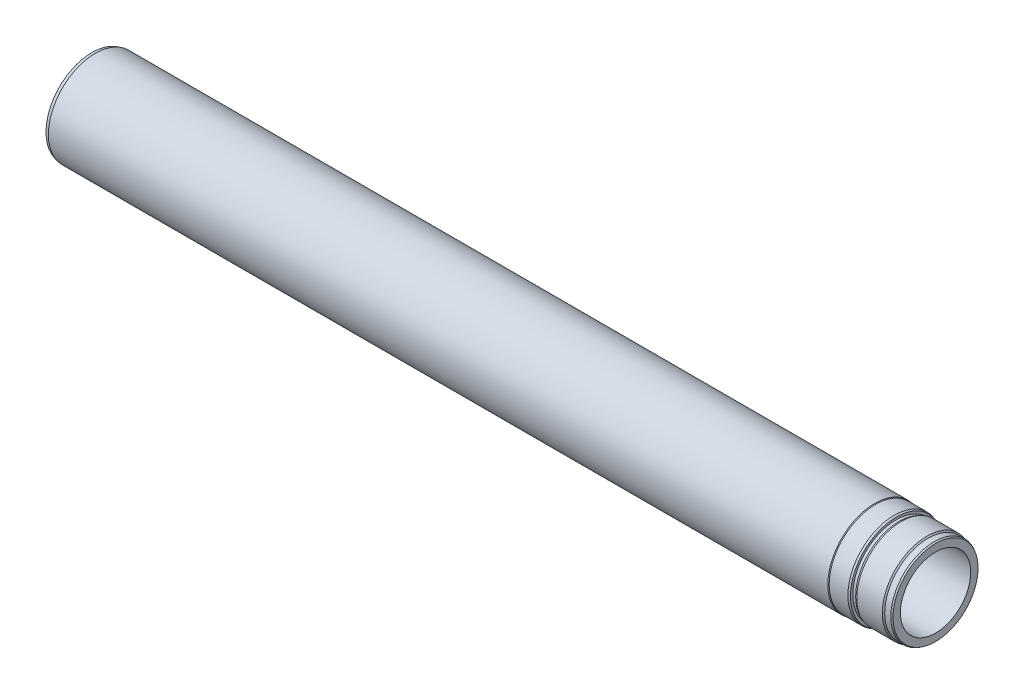
ISO-10303-21;
HEADER;
FILE_DESCRIPTION(('STEP AP214'),'2;1');
FILE_NAME('part.step','',(''),(''),'','','');
FILE_SCHEMA(('AUTOMOTIVE_DESIGN { 1 0 10303 214 1 1 1 1 }'));
ENDSEC;
DATA;
#1=APPLICATION_CONTEXT('core data for automotive mechanical design processes');
#2=APPLICATION_PROTOCOL_DEFINITION('international standard','automotive_design',2000,#1);
#3=PRODUCT_CONTEXT('',#1,'mechanical');
#4=PRODUCT('Part','Part','',(#3));
#5=PRODUCT_RELATED_PRODUCT_CATEGORY('part','',(#4));
#6=PRODUCT_DEFINITION_FORMATION('','',#4);
#7=PRODUCT_DEFINITION_CONTEXT('part definition',#1,'design');
#8=PRODUCT_DEFINITION('design','',#6,#7);
#9=PRODUCT_DEFINITION_SHAPE('','',#8);
#10=(LENGTH_UNIT() NAMED_UNIT(*) SI_UNIT(.MILLI.,.METRE.));
#11=(NAMED_UNIT(*) PLANE_ANGLE_UNIT() SI_UNIT($,.RADIAN.));
#12=(NAMED_UNIT(*) SI_UNIT($,.STERADIAN.) SOLID_ANGLE_UNIT());
#13=UNCERTAINTY_MEASURE_WITH_UNIT(LENGTH_MEASURE(1.E-05),#10,'distance_accuracy_value','');
#14=(GEOMETRIC_REPRESENTATION_CONTEXT(3) GLOBAL_UNCERTAINTY_ASSIGNED_CONTEXT((#13)) GLOBAL_UNIT_ASSIGNED_CONTEXT((#10,
#11,#12)) REPRESENTATION_CONTEXT('',''));
#15=CARTESIAN_POINT('',(0.,0.,0.));
#16=DIRECTION('',(0.,0.,1.));
#17=DIRECTION('',(1.,0.,0.));
#18=AXIS2_PLACEMENT_3D('',#15,#16,#17);
#19=CARTESIAN_POINT('',(-42.,0.,0.));
#20=DIRECTION('',(-1.,0.,0.));
#21=DIRECTION('',(0.,0.,1.));
#22=AXIS2_PLACEMENT_3D('',#19,#20,#21);
#23=CONICAL_SURFACE('',#22,48.7720595314676,0.349065850398868);
#24=CARTESIAN_POINT('',(-44.,0.,0.));
#25=DIRECTION('',(-1.,0.,0.));
#26=DIRECTION('',(0.,0.,1.));
#27=AXIS2_PLACEMENT_3D('',#24,#25,#26);
#28=CIRCLE('',#27,49.5);
#29=CARTESIAN_POINT('',(-44.,0.,49.5));
#30=VERTEX_POINT('',#29);
#31=EDGE_CURVE('E10',#30,#30,#28,.T.);
#32=ORIENTED_EDGE('',*,*,#31,.F.);
#33=EDGE_LOOP('',(#32));
#34=FACE_BOUND('',#33,.T.);
#35=CARTESIAN_POINT('',(-42.,0.,0.));
#36=DIRECTION('',(-1.,0.,0.));
#37=DIRECTION('',(0.,0.,1.));
#38=AXIS2_PLACEMENT_3D('',#35,#36,#37);
#39=CIRCLE('',#38,48.7720595314676);
#40=CARTESIAN_POINT('',(-42.,0.,48.7720595314676));
#41=VERTEX_POINT('',#40);
#42=EDGE_CURVE('E111',#41,#41,#39,.T.);
#43=ORIENTED_EDGE('',*,*,#42,.T.);
#44=EDGE_LOOP('',(#43));
#45=FACE_BOUND('',#44,.T.);
#46=ADVANCED_FACE('F47',(#34,#45),#23,.T.);
#47=CARTESIAN_POINT('',(-900.,0.,0.));
#48=DIRECTION('',(-1.,0.,0.));
#49=DIRECTION('',(0.,0.,1.));
#50=AXIS2_PLACEMENT_3D('',#47,#48,#49);
#51=CYLINDRICAL_SURFACE('',#50,49.5);
#52=CARTESIAN_POINT('',(-63.9999999999999,0.,0.));
#53=DIRECTION('',(-1.,0.,0.));
#54=DIRECTION('',(0.,0.,1.));
#55=AXIS2_PLACEMENT_3D('',#52,#53,#54);
#56=CIRCLE('',#55,49.5);
#57=CARTESIAN_POINT('',(-63.9999999999999,0.,49.5));
#58=VERTEX_POINT('',#57);
#59=EDGE_CURVE('E53',#58,#58,#56,.T.);
#60=ORIENTED_EDGE('',*,*,#59,.F.);
#61=EDGE_LOOP('',(#60));
#62=FACE_BOUND('',#61,.T.);
#63=ORIENTED_EDGE('',*,*,#31,.T.);
#64=EDGE_LOOP('',(#63));
#65=FACE_BOUND('',#64,.T.);
#66=ADVANCED_FACE('F128',(#62,#65),#51,.T.);
#67=CARTESIAN_POINT('',(-63.9999999999999,0.,0.));
#68=DIRECTION('',(-1.,0.,0.));
#69=DIRECTION('',(0.,0.,1.));
#70=AXIS2_PLACEMENT_3D('',#67,#68,#69);
#71=CONICAL_SURFACE('',#70,49.5,0.523598775598297);
#72=CARTESIAN_POINT('',(-64.8660254037844,0.,0.));
#73=DIRECTION('',(-1.,0.,0.));
#74=DIRECTION('',(0.,0.,1.));
#75=AXIS2_PLACEMENT_3D('',#72,#73,#74);
#76=CIRCLE('',#75,50.);
#77=CARTESIAN_POINT('',(-64.8660254037844,0.,50.));
#78=VERTEX_POINT('',#77);
#79=EDGE_CURVE('E57',#78,#78,#76,.T.);
#80=ORIENTED_EDGE('',*,*,#79,.F.);
#81=EDGE_LOOP('',(#80));
#82=FACE_BOUND('',#81,.T.);
#83=ORIENTED_EDGE('',*,*,#59,.T.);
#84=EDGE_LOOP('',(#83));
#85=FACE_BOUND('',#84,.T.);
#86=ADVANCED_FACE('F133',(#82,#85),#71,.T.);
#87=CARTESIAN_POINT('',(-900.,0.,0.));
#88=DIRECTION('',(-1.,0.,0.));
#89=DIRECTION('',(0.,0.,1.));
#90=AXIS2_PLACEMENT_3D('',#87,#88,#89);
#91=CYLINDRICAL_SURFACE('',#90,50.);
#92=CARTESIAN_POINT('',(-896.5,0.,0.));
#93=DIRECTION('',(-1.,0.,0.));
#94=DIRECTION('',(0.,0.,1.));
#95=AXIS2_PLACEMENT_3D('',#92,#93,#94);
#96=CIRCLE('',#95,49.9999999999999);
#97=CARTESIAN_POINT('',(-896.5,0.,49.9999999999999));
#98=VERTEX_POINT('',#97);
#99=EDGE_CURVE('E61',#98,#98,#96,.T.);
#100=ORIENTED_EDGE('',*,*,#99,.F.);
#101=EDGE_LOOP('',(#100));
#102=FACE_BOUND('',#101,.T.);
#103=ORIENTED_EDGE('',*,*,#79,.T.);
#104=EDGE_LOOP('',(#103));
#105=FACE_BOUND('',#104,.T.);
#106=ADVANCED_FACE('F138',(#102,#105),#91,.T.);
#107=CARTESIAN_POINT('',(-896.5,0.,0.));
#108=DIRECTION('',(1.,0.,0.));
#109=DIRECTION('',(0.,0.,-1.));
#110=AXIS2_PLACEMENT_3D('',#107,#108,#109);
#111=CONICAL_SURFACE('',#110,49.9999999999999,0.261799387799151);
#112=CARTESIAN_POINT('',(-900.,0.,0.));
#113=DIRECTION('',(-1.,0.,0.));
#114=DIRECTION('',(0.,0.,1.));
#115=AXIS2_PLACEMENT_3D('',#112,#113,#114);
#116=CIRCLE('',#115,49.062177826491);
#117=CARTESIAN_POINT('',(-900.,0.,49.062177826491));
#118=VERTEX_POINT('',#117);
#119=EDGE_CURVE('E66',#118,#118,#116,.T.);
#120=ORIENTED_EDGE('',*,*,#119,.F.);
#121=EDGE_LOOP('',(#120));
#122=FACE_BOUND('',#121,.T.);
#123=ORIENTED_EDGE('',*,*,#99,.T.);
#124=EDGE_LOOP('',(#123));
#125=FACE_BOUND('',#124,.T.);
#126=ADVANCED_FACE('F144',(#122,#125),#111,.T.);
#127=CARTESIAN_POINT('',(-900.,49.062177826491,0.));
#128=DIRECTION('',(1.,0.,0.));
#129=DIRECTION('',(0.,0.,-1.));
#130=AXIS2_PLACEMENT_3D('',#127,#128,#129);
#131=PLANE('',#130);
#132=CARTESIAN_POINT('',(-900.,0.,0.));
#133=DIRECTION('',(-1.,0.,0.));
#134=DIRECTION('',(0.,0.,1.));
#135=AXIS2_PLACEMENT_3D('',#132,#133,#134);
#136=CIRCLE('',#135,41.75);
#137=CARTESIAN_POINT('',(-900.,0.,41.75));
#138=VERTEX_POINT('',#137);
#139=EDGE_CURVE('E69',#138,#138,#136,.T.);
#140=ORIENTED_EDGE('',*,*,#139,.F.);
#141=EDGE_LOOP('',(#140));
#142=FACE_BOUND('',#141,.T.);
#143=ORIENTED_EDGE('',*,*,#119,.T.);
#144=EDGE_LOOP('',(#143));
#145=FACE_BOUND('',#144,.T.);
#146=ADVANCED_FACE('F148',(#142,#145),#131,.F.);
#147=CARTESIAN_POINT('',(-900.,0.,0.));
#148=DIRECTION('',(-1.,0.,0.));
#149=DIRECTION('',(0.,0.,1.));
#150=AXIS2_PLACEMENT_3D('',#147,#148,#149);
#151=CONICAL_SURFACE('',#150,41.75,0.785398163397464);
#152=CARTESIAN_POINT('',(-898.5,0.,0.));
#153=DIRECTION('',(-1.,0.,0.));
#154=DIRECTION('',(0.,0.,1.));
#155=AXIS2_PLACEMENT_3D('',#152,#153,#154);
#156=CIRCLE('',#155,40.25);
#157=CARTESIAN_POINT('',(-898.5,0.,40.25));
#158=VERTEX_POINT('',#157);
#159=EDGE_CURVE('E72',#158,#158,#156,.T.);
#160=ORIENTED_EDGE('',*,*,#159,.F.);
#161=EDGE_LOOP('',(#160));
#162=FACE_BOUND('',#161,.T.);
#163=ORIENTED_EDGE('',*,*,#139,.T.);
#164=EDGE_LOOP('',(#163));
#165=FACE_BOUND('',#164,.T.);
#166=ADVANCED_FACE('F152',(#162,#165),#151,.F.);
#167=CARTESIAN_POINT('',(-900.,0.,0.));
#168=DIRECTION('',(-1.,0.,0.));
#169=DIRECTION('',(0.,0.,1.));
#170=AXIS2_PLACEMENT_3D('',#167,#168,#169);
#171=CYLINDRICAL_SURFACE('',#170,40.25);
#172=CARTESIAN_POINT('',(-878.,0.,0.));
#173=DIRECTION('',(-1.,0.,0.));
#174=DIRECTION('',(0.,0.,1.));
#175=AXIS2_PLACEMENT_3D('',#172,#173,#174);
#176=CIRCLE('',#175,40.25);
#177=CARTESIAN_POINT('',(-878.,0.,40.25));
#178=VERTEX_POINT('',#177);
#179=EDGE_CURVE('E75',#178,#178,#176,.T.);
#180=ORIENTED_EDGE('',*,*,#179,.F.);
#181=EDGE_LOOP('',(#180));
#182=FACE_BOUND('',#181,.T.);
#183=ORIENTED_EDGE('',*,*,#159,.T.);
#184=EDGE_LOOP('',(#183));
#185=FACE_BOUND('',#184,.T.);
#186=ADVANCED_FACE('F156',(#182,#185),#171,.F.);
#187=CARTESIAN_POINT('',(-878.,0.,0.));
#188=DIRECTION('',(-1.,0.,0.));
#189=DIRECTION('',(0.,0.,1.));
#190=AXIS2_PLACEMENT_3D('',#187,#188,#189);
#191=CONICAL_SURFACE('',#190,40.25,0.523598775598308);
#192=CARTESIAN_POINT('',(-875.692042298915,0.,0.));
#193=DIRECTION('',(-1.,0.,0.));
#194=DIRECTION('',(0.,0.,1.));
#195=AXIS2_PLACEMENT_3D('',#192,#193,#194);
#196=CIRCLE('',#195,38.9175);
#197=CARTESIAN_POINT('',(-875.692042298915,0.,38.9175));
#198=VERTEX_POINT('',#197);
#199=EDGE_CURVE('E78',#198,#198,#196,.T.);
#200=ORIENTED_EDGE('',*,*,#199,.F.);
#201=EDGE_LOOP('',(#200));
#202=FACE_BOUND('',#201,.T.);
#203=ORIENTED_EDGE('',*,*,#179,.T.);
#204=EDGE_LOOP('',(#203));
#205=FACE_BOUND('',#204,.T.);
#206=ADVANCED_FACE('F160',(#202,#205),#191,.F.);
#207=CARTESIAN_POINT('',(-900.,0.,0.));
#208=DIRECTION('',(-1.,0.,0.));
#209=DIRECTION('',(0.,0.,1.));
#210=AXIS2_PLACEMENT_3D('',#207,#208,#209);
#211=CYLINDRICAL_SURFACE('',#210,38.9175);
#212=CARTESIAN_POINT('',(-825.,0.,0.));
#213=DIRECTION('',(-1.,0.,0.));
#214=DIRECTION('',(0.,0.,1.));
#215=AXIS2_PLACEMENT_3D('',#212,#213,#214);
#216=CIRCLE('',#215,38.9175);
#217=CARTESIAN_POINT('',(-825.,0.,38.9175));
#218=VERTEX_POINT('',#217);
#219=EDGE_CURVE('E81',#218,#218,#216,.T.);
#220=ORIENTED_EDGE('',*,*,#219,.F.);
#221=EDGE_LOOP('',(#220));
#222=FACE_BOUND('',#221,.T.);
#223=ORIENTED_EDGE('',*,*,#199,.T.);
#224=EDGE_LOOP('',(#223));
#225=FACE_BOUND('',#224,.T.);
#226=ADVANCED_FACE('F164',(#222,#225),#211,.F.);
#227=CARTESIAN_POINT('',(-825.,0.,0.));
#228=DIRECTION('',(-1.,0.,0.));
#229=DIRECTION('',(0.,0.,1.));
#230=AXIS2_PLACEMENT_3D('',#227,#228,#229);
#231=CONICAL_SURFACE('',#230,38.9175,0.174532925199434);
#232=CARTESIAN_POINT('',(-816.960958020692,0.,0.));
#233=DIRECTION('',(-1.,0.,0.));
#234=DIRECTION('',(0.,0.,1.));
#235=AXIS2_PLACEMENT_3D('',#232,#233,#234);
#236=CIRCLE('',#235,37.5);
#237=CARTESIAN_POINT('',(-816.960958020692,0.,37.5));
#238=VERTEX_POINT('',#237);
#239=EDGE_CURVE('E84',#238,#238,#236,.T.);
#240=ORIENTED_EDGE('',*,*,#239,.F.);
#241=EDGE_LOOP('',(#240));
#242=FACE_BOUND('',#241,.T.);
#243=ORIENTED_EDGE('',*,*,#219,.T.);
#244=EDGE_LOOP('',(#243));
#245=FACE_BOUND('',#244,.T.);
#246=ADVANCED_FACE('F168',(#242,#245),#231,.F.);
#247=CARTESIAN_POINT('',(-900.,0.,0.));
#248=DIRECTION('',(-1.,0.,0.));
#249=DIRECTION('',(0.,0.,1.));
#250=AXIS2_PLACEMENT_3D('',#247,#248,#249);
#251=CYLINDRICAL_SURFACE('',#250,37.5);
#252=CARTESIAN_POINT('',(0.,0.,0.));
#253=DIRECTION('',(-1.,0.,0.));
#254=DIRECTION('',(0.,0.,1.));
#255=AXIS2_PLACEMENT_3D('',#252,#253,#254);
#256=CIRCLE('',#255,37.5);
#257=CARTESIAN_POINT('',(0.,0.,37.5));
#258=VERTEX_POINT('',#257);
#259=EDGE_CURVE('E87',#258,#258,#256,.T.);
#260=ORIENTED_EDGE('',*,*,#259,.F.);
#261=EDGE_LOOP('',(#260));
#262=FACE_BOUND('',#261,.T.);
#263=ORIENTED_EDGE('',*,*,#239,.T.);
#264=EDGE_LOOP('',(#263));
#265=FACE_BOUND('',#264,.T.);
#266=ADVANCED_FACE('F172',(#262,#265),#251,.F.);
#267=CARTESIAN_POINT('',(0.,37.5,0.));
#268=DIRECTION('',(-1.,0.,0.));
#269=DIRECTION('',(0.,0.,1.));
#270=AXIS2_PLACEMENT_3D('',#267,#268,#269);
#271=PLANE('',#270);
#272=CARTESIAN_POINT('',(0.,0.,0.));
#273=DIRECTION('',(-1.,0.,0.));
#274=DIRECTION('',(0.,0.,1.));
#275=AXIS2_PLACEMENT_3D('',#272,#273,#274);
#276=CIRCLE('',#275,45.3839745962156);
#277=CARTESIAN_POINT('',(0.,0.,45.3839745962156));
#278=VERTEX_POINT('',#277);
#279=EDGE_CURVE('E90',#278,#278,#276,.T.);
#280=ORIENTED_EDGE('',*,*,#279,.F.);
#281=EDGE_LOOP('',(#280));
#282=FACE_BOUND('',#281,.T.);
#283=ORIENTED_EDGE('',*,*,#259,.T.);
#284=EDGE_LOOP('',(#283));
#285=FACE_BOUND('',#284,.T.);
#286=ADVANCED_FACE('F176',(#282,#285),#271,.F.);
#287=CARTESIAN_POINT('',(-1.49999999999995,0.,0.));
#288=DIRECTION('',(-1.,0.,0.));
#289=DIRECTION('',(0.,0.,1.));
#290=AXIS2_PLACEMENT_3D('',#287,#288,#289);
#291=CONICAL_SURFACE('',#290,46.25,0.52359877559831);
#292=ORIENTED_EDGE('',*,*,#279,.T.);
#293=EDGE_LOOP('',(#292));
#294=FACE_BOUND('',#293,.T.);
#295=CARTESIAN_POINT('',(-1.49999999999995,0.,0.));
#296=DIRECTION('',(-1.,0.,0.));
#297=DIRECTION('',(0.,0.,1.));
#298=AXIS2_PLACEMENT_3D('',#295,#296,#297);
#299=CIRCLE('',#298,46.25);
#300=CARTESIAN_POINT('',(-1.49999999999995,0.,46.25));
#301=VERTEX_POINT('',#300);
#302=EDGE_CURVE('E93',#301,#301,#299,.T.);
#303=ORIENTED_EDGE('',*,*,#302,.F.);
#304=EDGE_LOOP('',(#303));
#305=FACE_BOUND('',#304,.T.);
#306=ADVANCED_FACE('F180',(#294,#305),#291,.T.);
#307=CARTESIAN_POINT('',(-900.,0.,0.));
#308=DIRECTION('',(-1.,0.,0.));
#309=DIRECTION('',(0.,0.,1.));
#310=AXIS2_PLACEMENT_3D('',#307,#308,#309);
#311=CYLINDRICAL_SURFACE('',#310,46.25);
#312=CARTESIAN_POINT('',(-8.00000000000001,0.,0.));
#313=DIRECTION('',(-1.,0.,0.));
#314=DIRECTION('',(0.,0.,1.));
#315=AXIS2_PLACEMENT_3D('',#312,#313,#314);
#316=CIRCLE('',#315,46.25);
#317=CARTESIAN_POINT('',(-8.00000000000001,0.,46.25));
#318=VERTEX_POINT('',#317);
#319=EDGE_CURVE('E96',#318,#318,#316,.T.);
#320=ORIENTED_EDGE('',*,*,#319,.F.);
#321=EDGE_LOOP('',(#320));
#322=FACE_BOUND('',#321,.T.);
#323=ORIENTED_EDGE('',*,*,#302,.T.);
#324=EDGE_LOOP('',(#323));
#325=FACE_BOUND('',#324,.T.);
#326=ADVANCED_FACE('F184',(#322,#325),#311,.T.);
#327=CARTESIAN_POINT('',(-8.00000000000001,0.,0.));
#328=DIRECTION('',(-1.,0.,0.));
#329=DIRECTION('',(0.,0.,1.));
#330=AXIS2_PLACEMENT_3D('',#327,#328,#329);
#331=CONICAL_SURFACE('',#330,46.25,0.785398163397459);
#332=CARTESIAN_POINT('',(-9.24999999999998,0.,0.));
#333=DIRECTION('',(-1.,0.,0.));
#334=DIRECTION('',(0.,0.,1.));
#335=AXIS2_PLACEMENT_3D('',#332,#333,#334);
#336=CIRCLE('',#335,47.5);
#337=CARTESIAN_POINT('',(-9.24999999999998,0.,47.5));
#338=VERTEX_POINT('',#337);
#339=EDGE_CURVE('E99',#338,#338,#336,.T.);
#340=ORIENTED_EDGE('',*,*,#339,.F.);
#341=EDGE_LOOP('',(#340));
#342=FACE_BOUND('',#341,.T.);
#343=ORIENTED_EDGE('',*,*,#319,.T.);
#344=EDGE_LOOP('',(#343));
#345=FACE_BOUND('',#344,.T.);
#346=ADVANCED_FACE('F188',(#342,#345),#331,.T.);
#347=CARTESIAN_POINT('',(-900.,0.,0.));
#348=DIRECTION('',(-1.,0.,0.));
#349=DIRECTION('',(0.,0.,1.));
#350=AXIS2_PLACEMENT_3D('',#347,#348,#349);
#351=CYLINDRICAL_SURFACE('',#350,47.5);
#352=CARTESIAN_POINT('',(-36.5467368681185,0.,0.));
#353=DIRECTION('',(-1.,0.,0.));
#354=DIRECTION('',(0.,0.,1.));
#355=AXIS2_PLACEMENT_3D('',#352,#353,#354);
#356=CIRCLE('',#355,47.5);
#357=CARTESIAN_POINT('',(-36.5467368681185,0.,47.5));
#358=VERTEX_POINT('',#357);
#359=EDGE_CURVE('E102',#358,#358,#356,.T.);
#360=ORIENTED_EDGE('',*,*,#359,.F.);
#361=EDGE_LOOP('',(#360));
#362=FACE_BOUND('',#361,.T.);
#363=ORIENTED_EDGE('',*,*,#339,.T.);
#364=EDGE_LOOP('',(#363));
#365=FACE_BOUND('',#364,.T.);
#366=ADVANCED_FACE('F192',(#362,#365),#351,.T.);
#367=CARTESIAN_POINT('',(-39.,0.,0.));
#368=DIRECTION('',(1.,0.,0.));
#369=DIRECTION('',(0.,0.,-1.));
#370=AXIS2_PLACEMENT_3D('',#367,#368,#369);
#371=CONICAL_SURFACE('',#370,46.25,0.471238898038454);
#372=ORIENTED_EDGE('',*,*,#359,.T.);
#373=EDGE_LOOP('',(#372));
#374=FACE_BOUND('',#373,.T.);
#375=CARTESIAN_POINT('',(-39.,0.,0.));
#376=DIRECTION('',(-1.,0.,0.));
#377=DIRECTION('',(0.,0.,1.));
#378=AXIS2_PLACEMENT_3D('',#375,#376,#377);
#379=CIRCLE('',#378,46.25);
#380=CARTESIAN_POINT('',(-39.,0.,46.25));
#381=VERTEX_POINT('',#380);
#382=EDGE_CURVE('E105',#381,#381,#379,.T.);
#383=ORIENTED_EDGE('',*,*,#382,.F.);
#384=EDGE_LOOP('',(#383));
#385=FACE_BOUND('',#384,.T.);
#386=ADVANCED_FACE('F124',(#374,#385),#371,.T.);
#387=CARTESIAN_POINT('',(-900.,0.,0.));
#388=DIRECTION('',(-1.,0.,0.));
#389=DIRECTION('',(0.,0.,1.));
#390=AXIS2_PLACEMENT_3D('',#387,#388,#389);
#391=CYLINDRICAL_SURFACE('',#390,46.25);
#392=ORIENTED_EDGE('',*,*,#382,.T.);
#393=EDGE_LOOP('',(#392));
#394=FACE_BOUND('',#393,.T.);
#395=CARTESIAN_POINT('',(-42.,0.,0.));
#396=DIRECTION('',(-1.,0.,0.));
#397=DIRECTION('',(0.,0.,1.));
#398=AXIS2_PLACEMENT_3D('',#395,#396,#397);
#399=CIRCLE('',#398,46.25);
#400=CARTESIAN_POINT('',(-42.,0.,46.25));
#401=VERTEX_POINT('',#400);
#402=EDGE_CURVE('E108',#401,#401,#399,.T.);
#403=ORIENTED_EDGE('',*,*,#402,.F.);
#404=EDGE_LOOP('',(#403));
#405=FACE_BOUND('',#404,.T.);
#406=ADVANCED_FACE('F118',(#394,#405),#391,.T.);
#407=CARTESIAN_POINT('',(-42.,48.7720595314676,0.));
#408=DIRECTION('',(1.,0.,0.));
#409=DIRECTION('',(0.,0.,-1.));
#410=AXIS2_PLACEMENT_3D('',#407,#408,#409);
#411=PLANE('',#410);
#412=ORIENTED_EDGE('',*,*,#402,.T.);
#413=EDGE_LOOP('',(#412));
#414=FACE_BOUND('',#413,.T.);
#415=ORIENTED_EDGE('',*,*,#42,.F.);
#416=EDGE_LOOP('',(#415));
#417=FACE_BOUND('',#416,.T.);
#418=ADVANCED_FACE('F116',(#414,#417),#411,.T.);
#419=CLOSED_SHELL('',(#46,#66,#86,#106,#126,#146,#166,#186,#206,#226,#246,#266,#286,#306,#326,
#346,#366,#386,#406,#418));
#420=MANIFOLD_SOLID_BREP('B2',#419);
#421=ADVANCED_BREP_SHAPE_REPRESENTATION('',(#18,#420),#14);
#422=SHAPE_DEFINITION_REPRESENTATION(#9,#421);
ENDSEC;
END-ISO-10303-21;
